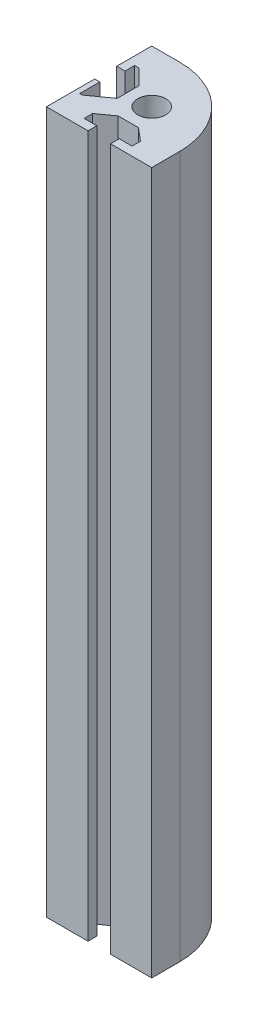
ISO-10303-21;
HEADER;
FILE_DESCRIPTION(('STEP AP214'),'2;1');
FILE_NAME('part.step','',(''),(''),'','','');
FILE_SCHEMA(('AUTOMOTIVE_DESIGN { 1 0 10303 214 1 1 1 1 }'));
ENDSEC;
DATA;
#1=APPLICATION_CONTEXT('core data for automotive mechanical design processes');
#2=APPLICATION_PROTOCOL_DEFINITION('international standard','automotive_design',2000,#1);
#3=PRODUCT_CONTEXT('',#1,'mechanical');
#4=PRODUCT('Part','Part','',(#3));
#5=PRODUCT_RELATED_PRODUCT_CATEGORY('part','',(#4));
#6=PRODUCT_DEFINITION_FORMATION('','',#4);
#7=PRODUCT_DEFINITION_CONTEXT('part definition',#1,'design');
#8=PRODUCT_DEFINITION('design','',#6,#7);
#9=PRODUCT_DEFINITION_SHAPE('','',#8);
#10=(LENGTH_UNIT() NAMED_UNIT(*) SI_UNIT(.MILLI.,.METRE.));
#11=(NAMED_UNIT(*) PLANE_ANGLE_UNIT() SI_UNIT($,.RADIAN.));
#12=(NAMED_UNIT(*) SI_UNIT($,.STERADIAN.) SOLID_ANGLE_UNIT());
#13=UNCERTAINTY_MEASURE_WITH_UNIT(LENGTH_MEASURE(1.E-05),#10,'distance_accuracy_value','');
#14=(GEOMETRIC_REPRESENTATION_CONTEXT(3) GLOBAL_UNCERTAINTY_ASSIGNED_CONTEXT((#13)) GLOBAL_UNIT_ASSIGNED_CONTEXT((#10,
#11,#12)) REPRESENTATION_CONTEXT('',''));
#15=CARTESIAN_POINT('',(0.,0.,0.));
#16=DIRECTION('',(0.,0.,1.));
#17=DIRECTION('',(1.,0.,0.));
#18=AXIS2_PLACEMENT_3D('',#15,#16,#17);
#19=CARTESIAN_POINT('',(-7.,200.,7.));
#20=DIRECTION('',(0.,-1.,0.));
#21=DIRECTION('',(0.,0.,-1.));
#22=AXIS2_PLACEMENT_3D('',#19,#20,#21);
#23=PLANE('',#22);
#24=DIRECTION('',(0.,0.,-1.));
#25=VECTOR('',#24,1.);
#26=CARTESIAN_POINT('',(15.,200.,15.));
#27=LINE('',#26,#25);
#28=CARTESIAN_POINT('',(15.,200.,15.));
#29=VERTEX_POINT('',#28);
#30=CARTESIAN_POINT('',(15.,200.,7.));
#31=VERTEX_POINT('',#30);
#32=EDGE_CURVE('E314',#29,#31,#27,.T.);
#33=ORIENTED_EDGE('',*,*,#32,.T.);
#34=CARTESIAN_POINT('',(-7.,200.,7.));
#35=DIRECTION('',(0.,1.,0.));
#36=DIRECTION('',(0.,0.,-1.));
#37=AXIS2_PLACEMENT_3D('',#34,#35,#36);
#38=CIRCLE('',#37,22.);
#39=CARTESIAN_POINT('',(-7.00000000000001,200.,-15.));
#40=VERTEX_POINT('',#39);
#41=EDGE_CURVE('E162',#31,#40,#38,.T.);
#42=ORIENTED_EDGE('',*,*,#41,.T.);
#43=DIRECTION('',(-1.,0.,0.));
#44=VECTOR('',#43,1.);
#45=CARTESIAN_POINT('',(-7.00000000000001,200.,-15.));
#46=LINE('',#45,#44);
#47=CARTESIAN_POINT('',(-15.,200.,-15.));
#48=VERTEX_POINT('',#47);
#49=EDGE_CURVE('E402',#40,#48,#46,.T.);
#50=ORIENTED_EDGE('',*,*,#49,.T.);
#51=DIRECTION('',(0.,0.,1.));
#52=VECTOR('',#51,1.);
#53=CARTESIAN_POINT('',(-15.,200.,-15.));
#54=LINE('',#53,#52);
#55=CARTESIAN_POINT('',(-15.,200.,-5.02760491674106));
#56=VERTEX_POINT('',#55);
#57=EDGE_CURVE('E421',#48,#56,#54,.T.);
#58=ORIENTED_EDGE('',*,*,#57,.T.);
#59=DIRECTION('',(1.,0.,0.));
#60=VECTOR('',#59,1.);
#61=CARTESIAN_POINT('',(-15.,200.,-5.02760491674106));
#62=LINE('',#61,#60);
#63=CARTESIAN_POINT('',(-12.62343706875,200.,-5.02760491674106));
#64=VERTEX_POINT('',#63);
#65=EDGE_CURVE('E418',#56,#64,#62,.T.);
#66=ORIENTED_EDGE('',*,*,#65,.T.);
#67=DIRECTION('',(0.,0.,-1.));
#68=VECTOR('',#67,1.);
#69=CARTESIAN_POINT('',(-12.62343706875,200.,-5.02760491674106));
#70=LINE('',#69,#68);
#71=CARTESIAN_POINT('',(-12.62343706875,200.,-7.75268234050665));
#72=VERTEX_POINT('',#71);
#73=EDGE_CURVE('E420',#64,#72,#70,.T.);
#74=ORIENTED_EDGE('',*,*,#73,.T.);
#75=DIRECTION('',(1.,0.,0.));
#76=VECTOR('',#75,1.);
#77=CARTESIAN_POINT('',(-12.62343706875,200.,-7.75268234050665));
#78=LINE('',#77,#76);
#79=CARTESIAN_POINT('',(-11.3205484379823,200.,-7.75268234050665));
#80=VERTEX_POINT('',#79);
#81=EDGE_CURVE('E423',#72,#80,#78,.T.);
#82=ORIENTED_EDGE('',*,*,#81,.T.);
#83=DIRECTION('',(0.707106781186548,0.,0.707106781186548));
#84=VECTOR('',#83,1.);
#85=CARTESIAN_POINT('',(-11.3205484379823,200.,-7.75268234050665));
#86=LINE('',#85,#84);
#87=CARTESIAN_POINT('',(-7.,200.,-3.43213390252437));
#88=VERTEX_POINT('',#87);
#89=EDGE_CURVE('E429',#80,#88,#86,.T.);
#90=ORIENTED_EDGE('',*,*,#89,.T.);
#91=DIRECTION('',(0.,0.,1.));
#92=VECTOR('',#91,1.);
#93=CARTESIAN_POINT('',(-7.,200.,-3.43213390252437));
#94=LINE('',#93,#92);
#95=CARTESIAN_POINT('',(-7.,200.,2.8610903108259));
#96=VERTEX_POINT('',#95);
#97=EDGE_CURVE('E431',#88,#96,#94,.T.);
#98=ORIENTED_EDGE('',*,*,#97,.T.);
#99=DIRECTION('',(-0.813663912579942,0.,0.581335563478702));
#100=VECTOR('',#99,1.);
#101=CARTESIAN_POINT('',(-7.,200.,2.8610903108259));
#102=LINE('',#101,#100);
#103=CARTESIAN_POINT('',(-12.793007796317,200.,7.00000000000001));
#104=VERTEX_POINT('',#103);
#105=EDGE_CURVE('E433',#96,#104,#102,.T.);
#106=ORIENTED_EDGE('',*,*,#105,.T.);
#107=DIRECTION('',(-1.,0.,0.));
#108=VECTOR('',#107,1.);
#109=CARTESIAN_POINT('',(-12.793007796317,200.,7.00000000000001));
#110=LINE('',#109,#108);
#111=CARTESIAN_POINT('',(-13.5272861174793,200.,7.00000000000001));
#112=VERTEX_POINT('',#111);
#113=EDGE_CURVE('E435',#104,#112,#110,.T.);
#114=ORIENTED_EDGE('',*,*,#113,.T.);
#115=DIRECTION('',(0.,0.,-1.));
#116=VECTOR('',#115,1.);
#117=CARTESIAN_POINT('',(-13.5272861174793,200.,7.00000000000001));
#118=LINE('',#117,#116);
#119=CARTESIAN_POINT('',(-13.5272861174793,200.,1.25796789040179));
#120=VERTEX_POINT('',#119);
#121=EDGE_CURVE('E437',#112,#120,#118,.T.);
#122=ORIENTED_EDGE('',*,*,#121,.T.);
#123=DIRECTION('',(-1.,0.,0.));
#124=VECTOR('',#123,1.);
#125=CARTESIAN_POINT('',(-13.5272861174793,200.,1.25796789040179));
#126=LINE('',#125,#124);
#127=CARTESIAN_POINT('',(-15.,200.,1.25796789040179));
#128=VERTEX_POINT('',#127);
#129=EDGE_CURVE('E439',#120,#128,#126,.T.);
#130=ORIENTED_EDGE('',*,*,#129,.T.);
#131=DIRECTION('',(0.,0.,1.));
#132=VECTOR('',#131,1.);
#133=CARTESIAN_POINT('',(-15.,200.,1.25796789040179));
#134=LINE('',#133,#132);
#135=CARTESIAN_POINT('',(-15.,200.,15.));
#136=VERTEX_POINT('',#135);
#137=EDGE_CURVE('E441',#128,#136,#134,.T.);
#138=ORIENTED_EDGE('',*,*,#137,.T.);
#139=DIRECTION('',(1.,0.,0.));
#140=VECTOR('',#139,1.);
#141=CARTESIAN_POINT('',(-15.,200.,15.));
#142=LINE('',#141,#140);
#143=CARTESIAN_POINT('',(-3.13994125446428,200.,15.));
#144=VERTEX_POINT('',#143);
#145=EDGE_CURVE('E443',#136,#144,#142,.T.);
#146=ORIENTED_EDGE('',*,*,#145,.T.);
#147=DIRECTION('',(0.,0.,-1.));
#148=VECTOR('',#147,1.);
#149=CARTESIAN_POINT('',(-3.13994125446428,200.,15.));
#150=LINE('',#149,#148);
#151=CARTESIAN_POINT('',(-3.13994125446428,200.,12.5058350189732));
#152=VERTEX_POINT('',#151);
#153=EDGE_CURVE('E445',#144,#152,#150,.T.);
#154=ORIENTED_EDGE('',*,*,#153,.T.);
#155=DIRECTION('',(-1.,0.,0.));
#156=VECTOR('',#155,1.);
#157=CARTESIAN_POINT('',(-3.13994125446428,200.,12.5058350189732));
#158=LINE('',#157,#156);
#159=CARTESIAN_POINT('',(-6.77895709017856,200.,12.5058350189732));
#160=VERTEX_POINT('',#159);
#161=EDGE_CURVE('E447',#152,#160,#158,.T.);
#162=ORIENTED_EDGE('',*,*,#161,.T.);
#163=DIRECTION('',(0.,0.,-1.));
#164=VECTOR('',#163,1.);
#165=CARTESIAN_POINT('',(-6.77895709017856,200.,12.5058350189732));
#166=LINE('',#165,#164);
#167=CARTESIAN_POINT('',(-6.77895709017856,200.,10.0798244618304));
#168=VERTEX_POINT('',#167);
#169=EDGE_CURVE('E449',#160,#168,#166,.T.);
#170=ORIENTED_EDGE('',*,*,#169,.T.);
#171=DIRECTION('',(0.813663912579942,0.,-0.581335563478702));
#172=VECTOR('',#171,1.);
#173=CARTESIAN_POINT('',(-6.77895709017856,200.,10.0798244618304));
#174=LINE('',#173,#172);
#175=CARTESIAN_POINT('',(-2.51290963769489,200.,7.03187670198325));
#176=VERTEX_POINT('',#175);
#177=EDGE_CURVE('E451',#168,#176,#174,.T.);
#178=ORIENTED_EDGE('',*,*,#177,.T.);
#179=DIRECTION('',(1.,0.,0.));
#180=VECTOR('',#179,1.);
#181=CARTESIAN_POINT('',(-2.51290963769489,200.,7.03187670198325));
#182=LINE('',#181,#180);
#183=CARTESIAN_POINT('',(3.25590475982143,200.,7.03187670198325));
#184=VERTEX_POINT('',#183);
#185=EDGE_CURVE('E453',#176,#184,#182,.T.);
#186=ORIENTED_EDGE('',*,*,#185,.T.);
#187=DIRECTION('',(0.766619760050027,0.,0.642101349866857));
#188=VECTOR('',#187,1.);
#189=CARTESIAN_POINT('',(3.25590475982143,200.,7.03187670198325));
#190=LINE('',#189,#188);
#191=CARTESIAN_POINT('',(6.89492059553572,200.,10.0798244618304));
#192=VERTEX_POINT('',#191);
#193=EDGE_CURVE('E455',#184,#192,#190,.T.);
#194=ORIENTED_EDGE('',*,*,#193,.T.);
#195=DIRECTION('',(0.,0.,1.));
#196=VECTOR('',#195,1.);
#197=CARTESIAN_POINT('',(6.89492059553572,200.,10.0798244618304));
#198=LINE('',#197,#196);
#199=CARTESIAN_POINT('',(6.89492059553572,200.,12.5058350189732));
#200=VERTEX_POINT('',#199);
#201=EDGE_CURVE('E232',#192,#200,#198,.T.);
#202=ORIENTED_EDGE('',*,*,#201,.T.);
#203=DIRECTION('',(-1.,0.,0.));
#204=VECTOR('',#203,1.);
#205=CARTESIAN_POINT('',(6.89492059553572,200.,12.5058350189732));
#206=LINE('',#205,#204);
#207=CARTESIAN_POINT('',(3.25590475982143,200.,12.5058350189732));
#208=VERTEX_POINT('',#207);
#209=EDGE_CURVE('E226',#200,#208,#206,.T.);
#210=ORIENTED_EDGE('',*,*,#209,.T.);
#211=DIRECTION('',(0.,0.,1.));
#212=VECTOR('',#211,1.);
#213=CARTESIAN_POINT('',(3.25590475982143,200.,12.5058350189732));
#214=LINE('',#213,#212);
#215=CARTESIAN_POINT('',(3.25590475982143,200.,15.));
#216=VERTEX_POINT('',#215);
#217=EDGE_CURVE('E230',#208,#216,#214,.T.);
#218=ORIENTED_EDGE('',*,*,#217,.T.);
#219=DIRECTION('',(1.,0.,0.));
#220=VECTOR('',#219,1.);
#221=CARTESIAN_POINT('',(3.25590475982143,200.,15.));
#222=LINE('',#221,#220);
#223=EDGE_CURVE('E57',#216,#29,#222,.T.);
#224=ORIENTED_EDGE('',*,*,#223,.T.);
#225=EDGE_LOOP('',(#33,#42,#50,#58,#66,#74,#82,#90,#98,#106,#114,#122,#130,#138,#146,#154,#162,
#170,#178,#186,#194,#202,#210,#218,#224));
#226=FACE_BOUND('',#225,.T.);
#227=CARTESIAN_POINT('',(0.,200.,0.));
#228=DIRECTION('',(0.,1.,0.));
#229=DIRECTION('',(0.,0.,1.));
#230=AXIS2_PLACEMENT_3D('',#227,#228,#229);
#231=CIRCLE('',#230,4.);
#232=CARTESIAN_POINT('',(0.,200.,4.));
#233=VERTEX_POINT('',#232);
#234=EDGE_CURVE('E256',#233,#233,#231,.T.);
#235=ORIENTED_EDGE('',*,*,#234,.F.);
#236=EDGE_LOOP('',(#235));
#237=FACE_BOUND('',#236,.T.);
#238=ADVANCED_FACE('F39',(#226,#237),#23,.F.);
#239=CARTESIAN_POINT('',(-7.,0.,7.));
#240=DIRECTION('',(0.,-1.,0.));
#241=DIRECTION('',(0.,0.,-1.));
#242=AXIS2_PLACEMENT_3D('',#239,#240,#241);
#243=PLANE('',#242);
#244=DIRECTION('',(0.,0.,-1.));
#245=VECTOR('',#244,1.);
#246=CARTESIAN_POINT('',(15.,0.,15.));
#247=LINE('',#246,#245);
#248=CARTESIAN_POINT('',(15.,0.,15.));
#249=VERTEX_POINT('',#248);
#250=CARTESIAN_POINT('',(15.,0.,7.));
#251=VERTEX_POINT('',#250);
#252=EDGE_CURVE('E251',#249,#251,#247,.T.);
#253=ORIENTED_EDGE('',*,*,#252,.F.);
#254=DIRECTION('',(1.,0.,0.));
#255=VECTOR('',#254,1.);
#256=CARTESIAN_POINT('',(3.25590475982143,0.,15.));
#257=LINE('',#256,#255);
#258=CARTESIAN_POINT('',(3.25590475982143,0.,15.));
#259=VERTEX_POINT('',#258);
#260=EDGE_CURVE('E154',#259,#249,#257,.T.);
#261=ORIENTED_EDGE('',*,*,#260,.F.);
#262=DIRECTION('',(0.,0.,1.));
#263=VECTOR('',#262,1.);
#264=CARTESIAN_POINT('',(3.25590475982143,0.,12.5058350189732));
#265=LINE('',#264,#263);
#266=CARTESIAN_POINT('',(3.25590475982143,0.,12.5058350189732));
#267=VERTEX_POINT('',#266);
#268=EDGE_CURVE('E148',#267,#259,#265,.T.);
#269=ORIENTED_EDGE('',*,*,#268,.F.);
#270=DIRECTION('',(-1.,0.,0.));
#271=VECTOR('',#270,1.);
#272=CARTESIAN_POINT('',(6.89492059553572,0.,12.5058350189732));
#273=LINE('',#272,#271);
#274=CARTESIAN_POINT('',(6.89492059553572,0.,12.5058350189732));
#275=VERTEX_POINT('',#274);
#276=EDGE_CURVE('E240',#275,#267,#273,.T.);
#277=ORIENTED_EDGE('',*,*,#276,.F.);
#278=DIRECTION('',(0.,0.,1.));
#279=VECTOR('',#278,1.);
#280=CARTESIAN_POINT('',(6.89492059553572,0.,10.0798244618304));
#281=LINE('',#280,#279);
#282=CARTESIAN_POINT('',(6.89492059553572,0.,10.0798244618304));
#283=VERTEX_POINT('',#282);
#284=EDGE_CURVE('E305',#283,#275,#281,.T.);
#285=ORIENTED_EDGE('',*,*,#284,.F.);
#286=DIRECTION('',(0.766619760050027,0.,0.642101349866857));
#287=VECTOR('',#286,1.);
#288=CARTESIAN_POINT('',(3.25590475982143,0.,7.03187670198325));
#289=LINE('',#288,#287);
#290=CARTESIAN_POINT('',(3.25590475982143,0.,7.03187670198325));
#291=VERTEX_POINT('',#290);
#292=EDGE_CURVE('E302',#291,#283,#289,.T.);
#293=ORIENTED_EDGE('',*,*,#292,.F.);
#294=DIRECTION('',(1.,0.,0.));
#295=VECTOR('',#294,1.);
#296=CARTESIAN_POINT('',(-2.51290963769489,0.,7.03187670198325));
#297=LINE('',#296,#295);
#298=CARTESIAN_POINT('',(-2.51290963769489,0.,7.03187670198325));
#299=VERTEX_POINT('',#298);
#300=EDGE_CURVE('E299',#299,#291,#297,.T.);
#301=ORIENTED_EDGE('',*,*,#300,.F.);
#302=DIRECTION('',(0.813663912579942,0.,-0.581335563478702));
#303=VECTOR('',#302,1.);
#304=CARTESIAN_POINT('',(-6.77895709017856,0.,10.0798244618304));
#305=LINE('',#304,#303);
#306=CARTESIAN_POINT('',(-6.77895709017856,0.,10.0798244618304));
#307=VERTEX_POINT('',#306);
#308=EDGE_CURVE('E296',#307,#299,#305,.T.);
#309=ORIENTED_EDGE('',*,*,#308,.F.);
#310=DIRECTION('',(0.,0.,-1.));
#311=VECTOR('',#310,1.);
#312=CARTESIAN_POINT('',(-6.77895709017856,0.,12.5058350189732));
#313=LINE('',#312,#311);
#314=CARTESIAN_POINT('',(-6.77895709017856,0.,12.5058350189732));
#315=VERTEX_POINT('',#314);
#316=EDGE_CURVE('E294',#315,#307,#313,.T.);
#317=ORIENTED_EDGE('',*,*,#316,.F.);
#318=DIRECTION('',(-1.,0.,0.));
#319=VECTOR('',#318,1.);
#320=CARTESIAN_POINT('',(-3.13994125446428,0.,12.5058350189732));
#321=LINE('',#320,#319);
#322=CARTESIAN_POINT('',(-3.13994125446428,0.,12.5058350189732));
#323=VERTEX_POINT('',#322);
#324=EDGE_CURVE('E292',#323,#315,#321,.T.);
#325=ORIENTED_EDGE('',*,*,#324,.F.);
#326=DIRECTION('',(0.,0.,-1.));
#327=VECTOR('',#326,1.);
#328=CARTESIAN_POINT('',(-3.13994125446428,0.,15.));
#329=LINE('',#328,#327);
#330=CARTESIAN_POINT('',(-3.13994125446428,0.,15.));
#331=VERTEX_POINT('',#330);
#332=EDGE_CURVE('E290',#331,#323,#329,.T.);
#333=ORIENTED_EDGE('',*,*,#332,.F.);
#334=DIRECTION('',(1.,0.,0.));
#335=VECTOR('',#334,1.);
#336=CARTESIAN_POINT('',(-15.,0.,15.));
#337=LINE('',#336,#335);
#338=CARTESIAN_POINT('',(-15.,0.,15.));
#339=VERTEX_POINT('',#338);
#340=EDGE_CURVE('E288',#339,#331,#337,.T.);
#341=ORIENTED_EDGE('',*,*,#340,.F.);
#342=DIRECTION('',(0.,0.,1.));
#343=VECTOR('',#342,1.);
#344=CARTESIAN_POINT('',(-15.,0.,1.25796789040179));
#345=LINE('',#344,#343);
#346=CARTESIAN_POINT('',(-15.,0.,1.25796789040179));
#347=VERTEX_POINT('',#346);
#348=EDGE_CURVE('E286',#347,#339,#345,.T.);
#349=ORIENTED_EDGE('',*,*,#348,.F.);
#350=DIRECTION('',(-1.,0.,0.));
#351=VECTOR('',#350,1.);
#352=CARTESIAN_POINT('',(-13.5272861174793,0.,1.25796789040179));
#353=LINE('',#352,#351);
#354=CARTESIAN_POINT('',(-13.5272861174793,0.,1.25796789040179));
#355=VERTEX_POINT('',#354);
#356=EDGE_CURVE('E284',#355,#347,#353,.T.);
#357=ORIENTED_EDGE('',*,*,#356,.F.);
#358=DIRECTION('',(0.,0.,-1.));
#359=VECTOR('',#358,1.);
#360=CARTESIAN_POINT('',(-13.5272861174793,0.,7.00000000000001));
#361=LINE('',#360,#359);
#362=CARTESIAN_POINT('',(-13.5272861174793,0.,7.00000000000001));
#363=VERTEX_POINT('',#362);
#364=EDGE_CURVE('E282',#363,#355,#361,.T.);
#365=ORIENTED_EDGE('',*,*,#364,.F.);
#366=DIRECTION('',(-1.,0.,0.));
#367=VECTOR('',#366,1.);
#368=CARTESIAN_POINT('',(-12.793007796317,0.,7.00000000000001));
#369=LINE('',#368,#367);
#370=CARTESIAN_POINT('',(-12.793007796317,0.,7.00000000000001));
#371=VERTEX_POINT('',#370);
#372=EDGE_CURVE('E280',#371,#363,#369,.T.);
#373=ORIENTED_EDGE('',*,*,#372,.F.);
#374=DIRECTION('',(-0.813663912579942,0.,0.581335563478702));
#375=VECTOR('',#374,1.);
#376=CARTESIAN_POINT('',(-7.,0.,2.8610903108259));
#377=LINE('',#376,#375);
#378=CARTESIAN_POINT('',(-7.,0.,2.8610903108259));
#379=VERTEX_POINT('',#378);
#380=EDGE_CURVE('E277',#379,#371,#377,.T.);
#381=ORIENTED_EDGE('',*,*,#380,.F.);
#382=DIRECTION('',(0.,0.,1.));
#383=VECTOR('',#382,1.);
#384=CARTESIAN_POINT('',(-7.,0.,-3.43213390252437));
#385=LINE('',#384,#383);
#386=CARTESIAN_POINT('',(-7.,0.,-3.43213390252437));
#387=VERTEX_POINT('',#386);
#388=EDGE_CURVE('E274',#387,#379,#385,.T.);
#389=ORIENTED_EDGE('',*,*,#388,.F.);
#390=DIRECTION('',(0.707106781186548,0.,0.707106781186548));
#391=VECTOR('',#390,1.);
#392=CARTESIAN_POINT('',(-11.3205484379823,0.,-7.75268234050665));
#393=LINE('',#392,#391);
#394=CARTESIAN_POINT('',(-11.3205484379823,0.,-7.75268234050665));
#395=VERTEX_POINT('',#394);
#396=EDGE_CURVE('E271',#395,#387,#393,.T.);
#397=ORIENTED_EDGE('',*,*,#396,.F.);
#398=DIRECTION('',(1.,0.,0.));
#399=VECTOR('',#398,1.);
#400=CARTESIAN_POINT('',(-12.62343706875,0.,-7.75268234050665));
#401=LINE('',#400,#399);
#402=CARTESIAN_POINT('',(-12.62343706875,0.,-7.75268234050665));
#403=VERTEX_POINT('',#402);
#404=EDGE_CURVE('E268',#403,#395,#401,.T.);
#405=ORIENTED_EDGE('',*,*,#404,.F.);
#406=DIRECTION('',(0.,0.,-1.));
#407=VECTOR('',#406,1.);
#408=CARTESIAN_POINT('',(-12.62343706875,0.,-5.02760491674106));
#409=LINE('',#408,#407);
#410=CARTESIAN_POINT('',(-12.62343706875,0.,-5.02760491674106));
#411=VERTEX_POINT('',#410);
#412=EDGE_CURVE('E266',#411,#403,#409,.T.);
#413=ORIENTED_EDGE('',*,*,#412,.F.);
#414=DIRECTION('',(1.,0.,0.));
#415=VECTOR('',#414,1.);
#416=CARTESIAN_POINT('',(-15.,0.,-5.02760491674106));
#417=LINE('',#416,#415);
#418=CARTESIAN_POINT('',(-15.,0.,-5.02760491674106));
#419=VERTEX_POINT('',#418);
#420=EDGE_CURVE('E264',#419,#411,#417,.T.);
#421=ORIENTED_EDGE('',*,*,#420,.F.);
#422=DIRECTION('',(0.,0.,1.));
#423=VECTOR('',#422,1.);
#424=CARTESIAN_POINT('',(-15.,0.,-15.));
#425=LINE('',#424,#423);
#426=CARTESIAN_POINT('',(-15.,0.,-15.));
#427=VERTEX_POINT('',#426);
#428=EDGE_CURVE('E262',#427,#419,#425,.T.);
#429=ORIENTED_EDGE('',*,*,#428,.F.);
#430=DIRECTION('',(-1.,0.,0.));
#431=VECTOR('',#430,1.);
#432=CARTESIAN_POINT('',(-7.00000000000001,0.,-15.));
#433=LINE('',#432,#431);
#434=CARTESIAN_POINT('',(-7.00000000000001,0.,-15.));
#435=VERTEX_POINT('',#434);
#436=EDGE_CURVE('E259',#435,#427,#433,.T.);
#437=ORIENTED_EDGE('',*,*,#436,.F.);
#438=CARTESIAN_POINT('',(-7.,0.,7.));
#439=DIRECTION('',(0.,1.,0.));
#440=DIRECTION('',(0.,0.,-1.));
#441=AXIS2_PLACEMENT_3D('',#438,#439,#440);
#442=CIRCLE('',#441,22.);
#443=EDGE_CURVE('E255',#251,#435,#442,.T.);
#444=ORIENTED_EDGE('',*,*,#443,.F.);
#445=EDGE_LOOP('',(#253,#261,#269,#277,#285,#293,#301,#309,#317,#325,#333,#341,#349,#357,#365,
#373,#381,#389,#397,#405,#413,#421,#429,#437,#444));
#446=FACE_BOUND('',#445,.T.);
#447=CARTESIAN_POINT('',(0.,0.,0.));
#448=DIRECTION('',(0.,1.,0.));
#449=DIRECTION('',(0.,0.,1.));
#450=AXIS2_PLACEMENT_3D('',#447,#448,#449);
#451=CIRCLE('',#450,4.);
#452=CARTESIAN_POINT('',(0.,0.,4.));
#453=VERTEX_POINT('',#452);
#454=EDGE_CURVE('E776',#453,#453,#451,.T.);
#455=ORIENTED_EDGE('',*,*,#454,.T.);
#456=EDGE_LOOP('',(#455));
#457=FACE_BOUND('',#456,.T.);
#458=ADVANCED_FACE('F406',(#446,#457),#243,.T.);
#459=CARTESIAN_POINT('',(15.,200.,15.));
#460=DIRECTION('',(-1.,0.,0.));
#461=DIRECTION('',(0.,0.,1.));
#462=AXIS2_PLACEMENT_3D('',#459,#460,#461);
#463=PLANE('',#462);
#464=ORIENTED_EDGE('',*,*,#252,.T.);
#465=DIRECTION('',(0.,-1.,0.));
#466=VECTOR('',#465,1.);
#467=CARTESIAN_POINT('',(15.,200.,7.));
#468=LINE('',#467,#466);
#469=EDGE_CURVE('E11',#31,#251,#468,.T.);
#470=ORIENTED_EDGE('',*,*,#469,.F.);
#471=ORIENTED_EDGE('',*,*,#32,.F.);
#472=DIRECTION('',(0.,-1.,0.));
#473=VECTOR('',#472,1.);
#474=CARTESIAN_POINT('',(15.,200.,15.));
#475=LINE('',#474,#473);
#476=EDGE_CURVE('E247',#29,#249,#475,.T.);
#477=ORIENTED_EDGE('',*,*,#476,.T.);
#478=EDGE_LOOP('',(#464,#470,#471,#477));
#479=FACE_BOUND('',#478,.T.);
#480=ADVANCED_FACE('F41',(#479),#463,.F.);
#481=CARTESIAN_POINT('',(-7.,200.,7.));
#482=DIRECTION('',(0.,-1.,0.));
#483=DIRECTION('',(0.,0.,-1.));
#484=AXIS2_PLACEMENT_3D('',#481,#482,#483);
#485=CYLINDRICAL_SURFACE('',#484,22.);
#486=ORIENTED_EDGE('',*,*,#443,.T.);
#487=DIRECTION('',(0.,-1.,0.));
#488=VECTOR('',#487,1.);
#489=CARTESIAN_POINT('',(-7.00000000000001,200.,-15.));
#490=LINE('',#489,#488);
#491=EDGE_CURVE('E49',#40,#435,#490,.T.);
#492=ORIENTED_EDGE('',*,*,#491,.F.);
#493=ORIENTED_EDGE('',*,*,#41,.F.);
#494=ORIENTED_EDGE('',*,*,#469,.T.);
#495=EDGE_LOOP('',(#486,#492,#493,#494));
#496=FACE_BOUND('',#495,.T.);
#497=ADVANCED_FACE('F489',(#496),#485,.T.);
#498=CARTESIAN_POINT('',(-7.00000000000001,200.,-15.));
#499=DIRECTION('',(0.,0.,1.));
#500=DIRECTION('',(1.,0.,0.));
#501=AXIS2_PLACEMENT_3D('',#498,#499,#500);
#502=PLANE('',#501);
#503=ORIENTED_EDGE('',*,*,#436,.T.);
#504=DIRECTION('',(0.,-1.,0.));
#505=VECTOR('',#504,1.);
#506=CARTESIAN_POINT('',(-15.,200.,-15.));
#507=LINE('',#506,#505);
#508=EDGE_CURVE('E392',#48,#427,#507,.T.);
#509=ORIENTED_EDGE('',*,*,#508,.F.);
#510=ORIENTED_EDGE('',*,*,#49,.F.);
#511=ORIENTED_EDGE('',*,*,#491,.T.);
#512=EDGE_LOOP('',(#503,#509,#510,#511));
#513=FACE_BOUND('',#512,.T.);
#514=ADVANCED_FACE('F400',(#513),#502,.F.);
#515=CARTESIAN_POINT('',(-15.,200.,-15.));
#516=DIRECTION('',(1.,0.,0.));
#517=DIRECTION('',(0.,0.,-1.));
#518=AXIS2_PLACEMENT_3D('',#515,#516,#517);
#519=PLANE('',#518);
#520=ORIENTED_EDGE('',*,*,#428,.T.);
#521=DIRECTION('',(0.,-1.,0.));
#522=VECTOR('',#521,1.);
#523=CARTESIAN_POINT('',(-15.,200.,-5.02760491674106));
#524=LINE('',#523,#522);
#525=EDGE_CURVE('E388',#56,#419,#524,.T.);
#526=ORIENTED_EDGE('',*,*,#525,.F.);
#527=ORIENTED_EDGE('',*,*,#57,.F.);
#528=ORIENTED_EDGE('',*,*,#508,.T.);
#529=EDGE_LOOP('',(#520,#526,#527,#528));
#530=FACE_BOUND('',#529,.T.);
#531=ADVANCED_FACE('F412',(#530),#519,.F.);
#532=CARTESIAN_POINT('',(-15.,200.,-5.02760491674106));
#533=DIRECTION('',(0.,0.,-1.));
#534=DIRECTION('',(-1.,0.,0.));
#535=AXIS2_PLACEMENT_3D('',#532,#533,#534);
#536=PLANE('',#535);
#537=ORIENTED_EDGE('',*,*,#420,.T.);
#538=DIRECTION('',(0.,-1.,0.));
#539=VECTOR('',#538,1.);
#540=CARTESIAN_POINT('',(-12.62343706875,200.,-5.02760491674106));
#541=LINE('',#540,#539);
#542=EDGE_CURVE('E384',#64,#411,#541,.T.);
#543=ORIENTED_EDGE('',*,*,#542,.F.);
#544=ORIENTED_EDGE('',*,*,#65,.F.);
#545=ORIENTED_EDGE('',*,*,#525,.T.);
#546=EDGE_LOOP('',(#537,#543,#544,#545));
#547=FACE_BOUND('',#546,.T.);
#548=ADVANCED_FACE('F416',(#547),#536,.F.);
#549=CARTESIAN_POINT('',(-12.62343706875,200.,-5.02760491674106));
#550=DIRECTION('',(-1.,0.,0.));
#551=DIRECTION('',(0.,0.,1.));
#552=AXIS2_PLACEMENT_3D('',#549,#550,#551);
#553=PLANE('',#552);
#554=ORIENTED_EDGE('',*,*,#412,.T.);
#555=DIRECTION('',(0.,-1.,0.));
#556=VECTOR('',#555,1.);
#557=CARTESIAN_POINT('',(-12.62343706875,200.,-7.75268234050665));
#558=LINE('',#557,#556);
#559=EDGE_CURVE('E380',#72,#403,#558,.T.);
#560=ORIENTED_EDGE('',*,*,#559,.F.);
#561=ORIENTED_EDGE('',*,*,#73,.F.);
#562=ORIENTED_EDGE('',*,*,#542,.T.);
#563=EDGE_LOOP('',(#554,#560,#561,#562));
#564=FACE_BOUND('',#563,.T.);
#565=ADVANCED_FACE('F502',(#564),#553,.F.);
#566=CARTESIAN_POINT('',(-12.62343706875,200.,-7.75268234050665));
#567=DIRECTION('',(0.,0.,-1.));
#568=DIRECTION('',(-1.,0.,0.));
#569=AXIS2_PLACEMENT_3D('',#566,#567,#568);
#570=PLANE('',#569);
#571=ORIENTED_EDGE('',*,*,#404,.T.);
#572=DIRECTION('',(0.,-1.,0.));
#573=VECTOR('',#572,1.);
#574=CARTESIAN_POINT('',(-11.3205484379823,200.,-7.75268234050665));
#575=LINE('',#574,#573);
#576=EDGE_CURVE('E376',#80,#395,#575,.T.);
#577=ORIENTED_EDGE('',*,*,#576,.F.);
#578=ORIENTED_EDGE('',*,*,#81,.F.);
#579=ORIENTED_EDGE('',*,*,#559,.T.);
#580=EDGE_LOOP('',(#571,#577,#578,#579));
#581=FACE_BOUND('',#580,.T.);
#582=ADVANCED_FACE('F505',(#581),#570,.F.);
#583=CARTESIAN_POINT('',(-11.3205484379823,200.,-7.75268234050665));
#584=DIRECTION('',(0.707106781186548,0.,-0.707106781186548));
#585=DIRECTION('',(-0.707106781186548,0.,-0.707106781186548));
#586=AXIS2_PLACEMENT_3D('',#583,#584,#585);
#587=PLANE('',#586);
#588=ORIENTED_EDGE('',*,*,#396,.T.);
#589=DIRECTION('',(0.,-1.,0.));
#590=VECTOR('',#589,1.);
#591=CARTESIAN_POINT('',(-7.,200.,-3.43213390252437));
#592=LINE('',#591,#590);
#593=EDGE_CURVE('E372',#88,#387,#592,.T.);
#594=ORIENTED_EDGE('',*,*,#593,.F.);
#595=ORIENTED_EDGE('',*,*,#89,.F.);
#596=ORIENTED_EDGE('',*,*,#576,.T.);
#597=EDGE_LOOP('',(#588,#594,#595,#596));
#598=FACE_BOUND('',#597,.T.);
#599=ADVANCED_FACE('F509',(#598),#587,.F.);
#600=CARTESIAN_POINT('',(-7.,200.,-3.43213390252437));
#601=DIRECTION('',(1.,0.,0.));
#602=DIRECTION('',(0.,0.,-1.));
#603=AXIS2_PLACEMENT_3D('',#600,#601,#602);
#604=PLANE('',#603);
#605=ORIENTED_EDGE('',*,*,#388,.T.);
#606=DIRECTION('',(0.,-1.,0.));
#607=VECTOR('',#606,1.);
#608=CARTESIAN_POINT('',(-7.,200.,2.8610903108259));
#609=LINE('',#608,#607);
#610=EDGE_CURVE('E368',#96,#379,#609,.T.);
#611=ORIENTED_EDGE('',*,*,#610,.F.);
#612=ORIENTED_EDGE('',*,*,#97,.F.);
#613=ORIENTED_EDGE('',*,*,#593,.T.);
#614=EDGE_LOOP('',(#605,#611,#612,#613));
#615=FACE_BOUND('',#614,.T.);
#616=ADVANCED_FACE('F513',(#615),#604,.F.);
#617=CARTESIAN_POINT('',(-7.,200.,2.8610903108259));
#618=DIRECTION('',(0.581335563478702,0.,0.813663912579942));
#619=DIRECTION('',(0.813663912579942,0.,-0.581335563478702));
#620=AXIS2_PLACEMENT_3D('',#617,#618,#619);
#621=PLANE('',#620);
#622=ORIENTED_EDGE('',*,*,#380,.T.);
#623=DIRECTION('',(0.,-1.,0.));
#624=VECTOR('',#623,1.);
#625=CARTESIAN_POINT('',(-12.793007796317,200.,7.00000000000001));
#626=LINE('',#625,#624);
#627=EDGE_CURVE('E364',#104,#371,#626,.T.);
#628=ORIENTED_EDGE('',*,*,#627,.F.);
#629=ORIENTED_EDGE('',*,*,#105,.F.);
#630=ORIENTED_EDGE('',*,*,#610,.T.);
#631=EDGE_LOOP('',(#622,#628,#629,#630));
#632=FACE_BOUND('',#631,.T.);
#633=ADVANCED_FACE('F517',(#632),#621,.F.);
#634=CARTESIAN_POINT('',(-12.793007796317,200.,7.00000000000001));
#635=DIRECTION('',(0.,0.,1.));
#636=DIRECTION('',(1.,0.,0.));
#637=AXIS2_PLACEMENT_3D('',#634,#635,#636);
#638=PLANE('',#637);
#639=ORIENTED_EDGE('',*,*,#372,.T.);
#640=DIRECTION('',(0.,-1.,0.));
#641=VECTOR('',#640,1.);
#642=CARTESIAN_POINT('',(-13.5272861174793,200.,7.00000000000001));
#643=LINE('',#642,#641);
#644=EDGE_CURVE('E360',#112,#363,#643,.T.);
#645=ORIENTED_EDGE('',*,*,#644,.F.);
#646=ORIENTED_EDGE('',*,*,#113,.F.);
#647=ORIENTED_EDGE('',*,*,#627,.T.);
#648=EDGE_LOOP('',(#639,#645,#646,#647));
#649=FACE_BOUND('',#648,.T.);
#650=ADVANCED_FACE('F521',(#649),#638,.F.);
#651=CARTESIAN_POINT('',(-13.5272861174793,200.,7.00000000000001));
#652=DIRECTION('',(-1.,0.,0.));
#653=DIRECTION('',(0.,0.,1.));
#654=AXIS2_PLACEMENT_3D('',#651,#652,#653);
#655=PLANE('',#654);
#656=ORIENTED_EDGE('',*,*,#364,.T.);
#657=DIRECTION('',(0.,-1.,0.));
#658=VECTOR('',#657,1.);
#659=CARTESIAN_POINT('',(-13.5272861174793,200.,1.25796789040179));
#660=LINE('',#659,#658);
#661=EDGE_CURVE('E356',#120,#355,#660,.T.);
#662=ORIENTED_EDGE('',*,*,#661,.F.);
#663=ORIENTED_EDGE('',*,*,#121,.F.);
#664=ORIENTED_EDGE('',*,*,#644,.T.);
#665=EDGE_LOOP('',(#656,#662,#663,#664));
#666=FACE_BOUND('',#665,.T.);
#667=ADVANCED_FACE('F525',(#666),#655,.F.);
#668=CARTESIAN_POINT('',(-13.5272861174793,200.,1.25796789040179));
#669=DIRECTION('',(0.,0.,1.));
#670=DIRECTION('',(1.,0.,0.));
#671=AXIS2_PLACEMENT_3D('',#668,#669,#670);
#672=PLANE('',#671);
#673=ORIENTED_EDGE('',*,*,#356,.T.);
#674=DIRECTION('',(0.,-1.,0.));
#675=VECTOR('',#674,1.);
#676=CARTESIAN_POINT('',(-15.,200.,1.25796789040179));
#677=LINE('',#676,#675);
#678=EDGE_CURVE('E352',#128,#347,#677,.T.);
#679=ORIENTED_EDGE('',*,*,#678,.F.);
#680=ORIENTED_EDGE('',*,*,#129,.F.);
#681=ORIENTED_EDGE('',*,*,#661,.T.);
#682=EDGE_LOOP('',(#673,#679,#680,#681));
#683=FACE_BOUND('',#682,.T.);
#684=ADVANCED_FACE('F529',(#683),#672,.F.);
#685=CARTESIAN_POINT('',(-15.,200.,1.25796789040179));
#686=DIRECTION('',(1.,0.,0.));
#687=DIRECTION('',(0.,0.,-1.));
#688=AXIS2_PLACEMENT_3D('',#685,#686,#687);
#689=PLANE('',#688);
#690=ORIENTED_EDGE('',*,*,#348,.T.);
#691=DIRECTION('',(0.,-1.,0.));
#692=VECTOR('',#691,1.);
#693=CARTESIAN_POINT('',(-15.,200.,15.));
#694=LINE('',#693,#692);
#695=EDGE_CURVE('E349',#136,#339,#694,.T.);
#696=ORIENTED_EDGE('',*,*,#695,.F.);
#697=ORIENTED_EDGE('',*,*,#137,.F.);
#698=ORIENTED_EDGE('',*,*,#678,.T.);
#699=EDGE_LOOP('',(#690,#696,#697,#698));
#700=FACE_BOUND('',#699,.T.);
#701=ADVANCED_FACE('F533',(#700),#689,.F.);
#702=CARTESIAN_POINT('',(-15.,200.,15.));
#703=DIRECTION('',(0.,0.,-1.));
#704=DIRECTION('',(-1.,0.,0.));
#705=AXIS2_PLACEMENT_3D('',#702,#703,#704);
#706=PLANE('',#705);
#707=ORIENTED_EDGE('',*,*,#340,.T.);
#708=DIRECTION('',(0.,-1.,0.));
#709=VECTOR('',#708,1.);
#710=CARTESIAN_POINT('',(-3.13994125446428,200.,15.));
#711=LINE('',#710,#709);
#712=EDGE_CURVE('E345',#144,#331,#711,.T.);
#713=ORIENTED_EDGE('',*,*,#712,.F.);
#714=ORIENTED_EDGE('',*,*,#145,.F.);
#715=ORIENTED_EDGE('',*,*,#695,.T.);
#716=EDGE_LOOP('',(#707,#713,#714,#715));
#717=FACE_BOUND('',#716,.T.);
#718=ADVANCED_FACE('F537',(#717),#706,.F.);
#719=CARTESIAN_POINT('',(-3.13994125446428,200.,15.));
#720=DIRECTION('',(-1.,0.,0.));
#721=DIRECTION('',(0.,0.,1.));
#722=AXIS2_PLACEMENT_3D('',#719,#720,#721);
#723=PLANE('',#722);
#724=ORIENTED_EDGE('',*,*,#332,.T.);
#725=DIRECTION('',(0.,-1.,0.));
#726=VECTOR('',#725,1.);
#727=CARTESIAN_POINT('',(-3.13994125446428,200.,12.5058350189732));
#728=LINE('',#727,#726);
#729=EDGE_CURVE('E341',#152,#323,#728,.T.);
#730=ORIENTED_EDGE('',*,*,#729,.F.);
#731=ORIENTED_EDGE('',*,*,#153,.F.);
#732=ORIENTED_EDGE('',*,*,#712,.T.);
#733=EDGE_LOOP('',(#724,#730,#731,#732));
#734=FACE_BOUND('',#733,.T.);
#735=ADVANCED_FACE('F541',(#734),#723,.F.);
#736=CARTESIAN_POINT('',(-3.13994125446428,200.,12.5058350189732));
#737=DIRECTION('',(0.,0.,1.));
#738=DIRECTION('',(1.,0.,0.));
#739=AXIS2_PLACEMENT_3D('',#736,#737,#738);
#740=PLANE('',#739);
#741=ORIENTED_EDGE('',*,*,#324,.T.);
#742=DIRECTION('',(0.,-1.,0.));
#743=VECTOR('',#742,1.);
#744=CARTESIAN_POINT('',(-6.77895709017856,200.,12.5058350189732));
#745=LINE('',#744,#743);
#746=EDGE_CURVE('E337',#160,#315,#745,.T.);
#747=ORIENTED_EDGE('',*,*,#746,.F.);
#748=ORIENTED_EDGE('',*,*,#161,.F.);
#749=ORIENTED_EDGE('',*,*,#729,.T.);
#750=EDGE_LOOP('',(#741,#747,#748,#749));
#751=FACE_BOUND('',#750,.T.);
#752=ADVANCED_FACE('F545',(#751),#740,.F.);
#753=CARTESIAN_POINT('',(-6.77895709017856,200.,12.5058350189732));
#754=DIRECTION('',(-1.,0.,0.));
#755=DIRECTION('',(0.,0.,1.));
#756=AXIS2_PLACEMENT_3D('',#753,#754,#755);
#757=PLANE('',#756);
#758=ORIENTED_EDGE('',*,*,#316,.T.);
#759=DIRECTION('',(0.,-1.,0.));
#760=VECTOR('',#759,1.);
#761=CARTESIAN_POINT('',(-6.77895709017856,200.,10.0798244618304));
#762=LINE('',#761,#760);
#763=EDGE_CURVE('E333',#168,#307,#762,.T.);
#764=ORIENTED_EDGE('',*,*,#763,.F.);
#765=ORIENTED_EDGE('',*,*,#169,.F.);
#766=ORIENTED_EDGE('',*,*,#746,.T.);
#767=EDGE_LOOP('',(#758,#764,#765,#766));
#768=FACE_BOUND('',#767,.T.);
#769=ADVANCED_FACE('F549',(#768),#757,.F.);
#770=CARTESIAN_POINT('',(-6.77895709017856,200.,10.0798244618304));
#771=DIRECTION('',(-0.581335563478702,0.,-0.813663912579943));
#772=DIRECTION('',(-0.813663912579943,0.,0.581335563478702));
#773=AXIS2_PLACEMENT_3D('',#770,#771,#772);
#774=PLANE('',#773);
#775=ORIENTED_EDGE('',*,*,#308,.T.);
#776=DIRECTION('',(0.,-1.,0.));
#777=VECTOR('',#776,1.);
#778=CARTESIAN_POINT('',(-2.51290963769489,200.,7.03187670198325));
#779=LINE('',#778,#777);
#780=EDGE_CURVE('E329',#176,#299,#779,.T.);
#781=ORIENTED_EDGE('',*,*,#780,.F.);
#782=ORIENTED_EDGE('',*,*,#177,.F.);
#783=ORIENTED_EDGE('',*,*,#763,.T.);
#784=EDGE_LOOP('',(#775,#781,#782,#783));
#785=FACE_BOUND('',#784,.T.);
#786=ADVANCED_FACE('F553',(#785),#774,.F.);
#787=CARTESIAN_POINT('',(-2.51290963769489,200.,7.03187670198325));
#788=DIRECTION('',(0.,0.,-1.));
#789=DIRECTION('',(-1.,0.,0.));
#790=AXIS2_PLACEMENT_3D('',#787,#788,#789);
#791=PLANE('',#790);
#792=ORIENTED_EDGE('',*,*,#300,.T.);
#793=DIRECTION('',(0.,-1.,0.));
#794=VECTOR('',#793,1.);
#795=CARTESIAN_POINT('',(3.25590475982143,200.,7.03187670198325));
#796=LINE('',#795,#794);
#797=EDGE_CURVE('E325',#184,#291,#796,.T.);
#798=ORIENTED_EDGE('',*,*,#797,.F.);
#799=ORIENTED_EDGE('',*,*,#185,.F.);
#800=ORIENTED_EDGE('',*,*,#780,.T.);
#801=EDGE_LOOP('',(#792,#798,#799,#800));
#802=FACE_BOUND('',#801,.T.);
#803=ADVANCED_FACE('F557',(#802),#791,.F.);
#804=CARTESIAN_POINT('',(3.25590475982143,200.,7.03187670198325));
#805=DIRECTION('',(0.642101349866857,0.,-0.766619760050027));
#806=DIRECTION('',(-0.766619760050027,0.,-0.642101349866857));
#807=AXIS2_PLACEMENT_3D('',#804,#805,#806);
#808=PLANE('',#807);
#809=ORIENTED_EDGE('',*,*,#292,.T.);
#810=DIRECTION('',(0.,-1.,0.));
#811=VECTOR('',#810,1.);
#812=CARTESIAN_POINT('',(6.89492059553572,200.,10.0798244618304));
#813=LINE('',#812,#811);
#814=EDGE_CURVE('E321',#192,#283,#813,.T.);
#815=ORIENTED_EDGE('',*,*,#814,.F.);
#816=ORIENTED_EDGE('',*,*,#193,.F.);
#817=ORIENTED_EDGE('',*,*,#797,.T.);
#818=EDGE_LOOP('',(#809,#815,#816,#817));
#819=FACE_BOUND('',#818,.T.);
#820=ADVANCED_FACE('F461',(#819),#808,.F.);
#821=CARTESIAN_POINT('',(6.89492059553572,200.,10.0798244618304));
#822=DIRECTION('',(1.,0.,0.));
#823=DIRECTION('',(0.,0.,-1.));
#824=AXIS2_PLACEMENT_3D('',#821,#822,#823);
#825=PLANE('',#824);
#826=ORIENTED_EDGE('',*,*,#284,.T.);
#827=DIRECTION('',(0.,-1.,0.));
#828=VECTOR('',#827,1.);
#829=CARTESIAN_POINT('',(6.89492059553572,200.,12.5058350189732));
#830=LINE('',#829,#828);
#831=EDGE_CURVE('E242',#200,#275,#830,.T.);
#832=ORIENTED_EDGE('',*,*,#831,.F.);
#833=ORIENTED_EDGE('',*,*,#201,.F.);
#834=ORIENTED_EDGE('',*,*,#814,.T.);
#835=EDGE_LOOP('',(#826,#832,#833,#834));
#836=FACE_BOUND('',#835,.T.);
#837=ADVANCED_FACE('F465',(#836),#825,.F.);
#838=CARTESIAN_POINT('',(6.89492059553572,200.,12.5058350189732));
#839=DIRECTION('',(0.,0.,1.));
#840=DIRECTION('',(1.,0.,0.));
#841=AXIS2_PLACEMENT_3D('',#838,#839,#840);
#842=PLANE('',#841);
#843=ORIENTED_EDGE('',*,*,#276,.T.);
#844=DIRECTION('',(0.,-1.,0.));
#845=VECTOR('',#844,1.);
#846=CARTESIAN_POINT('',(3.25590475982143,200.,12.5058350189732));
#847=LINE('',#846,#845);
#848=EDGE_CURVE('E237',#208,#267,#847,.T.);
#849=ORIENTED_EDGE('',*,*,#848,.F.);
#850=ORIENTED_EDGE('',*,*,#209,.F.);
#851=ORIENTED_EDGE('',*,*,#831,.T.);
#852=EDGE_LOOP('',(#843,#849,#850,#851));
#853=FACE_BOUND('',#852,.T.);
#854=ADVANCED_FACE('F238',(#853),#842,.F.);
#855=CARTESIAN_POINT('',(3.25590475982143,200.,12.5058350189732));
#856=DIRECTION('',(1.,0.,0.));
#857=DIRECTION('',(0.,0.,-1.));
#858=AXIS2_PLACEMENT_3D('',#855,#856,#857);
#859=PLANE('',#858);
#860=ORIENTED_EDGE('',*,*,#268,.T.);
#861=DIRECTION('',(0.,-1.,0.));
#862=VECTOR('',#861,1.);
#863=CARTESIAN_POINT('',(3.25590475982143,200.,15.));
#864=LINE('',#863,#862);
#865=EDGE_CURVE('E243',#216,#259,#864,.T.);
#866=ORIENTED_EDGE('',*,*,#865,.F.);
#867=ORIENTED_EDGE('',*,*,#217,.F.);
#868=ORIENTED_EDGE('',*,*,#848,.T.);
#869=EDGE_LOOP('',(#860,#866,#867,#868));
#870=FACE_BOUND('',#869,.T.);
#871=ADVANCED_FACE('F245',(#870),#859,.F.);
#872=CARTESIAN_POINT('',(3.25590475982143,200.,15.));
#873=DIRECTION('',(0.,0.,-1.));
#874=DIRECTION('',(-1.,0.,0.));
#875=AXIS2_PLACEMENT_3D('',#872,#873,#874);
#876=PLANE('',#875);
#877=ORIENTED_EDGE('',*,*,#260,.T.);
#878=ORIENTED_EDGE('',*,*,#476,.F.);
#879=ORIENTED_EDGE('',*,*,#223,.F.);
#880=ORIENTED_EDGE('',*,*,#865,.T.);
#881=EDGE_LOOP('',(#877,#878,#879,#880));
#882=FACE_BOUND('',#881,.T.);
#883=ADVANCED_FACE('F469',(#882),#876,.F.);
#884=CARTESIAN_POINT('',(0.,200.,0.));
#885=DIRECTION('',(0.,-1.,0.));
#886=DIRECTION('',(0.,0.,-1.));
#887=AXIS2_PLACEMENT_3D('',#884,#885,#886);
#888=CYLINDRICAL_SURFACE('',#887,4.);
#889=ORIENTED_EDGE('',*,*,#234,.T.);
#890=EDGE_LOOP('',(#889));
#891=FACE_BOUND('',#890,.T.);
#892=ORIENTED_EDGE('',*,*,#454,.F.);
#893=EDGE_LOOP('',(#892));
#894=FACE_BOUND('',#893,.T.);
#895=ADVANCED_FACE('F471',(#891,#894),#888,.F.);
#896=CLOSED_SHELL('',(#238,#458,#480,#497,#514,#531,#548,#565,#582,#599,#616,#633,#650,#667,
#684,#701,#718,#735,#752,#769,#786,#803,#820,#837,#854,#871,#883,#895));
#897=MANIFOLD_SOLID_BREP('B2',#896);
#898=ADVANCED_BREP_SHAPE_REPRESENTATION('',(#18,#897),#14);
#899=SHAPE_DEFINITION_REPRESENTATION(#9,#898);
ENDSEC;
END-ISO-10303-21;
